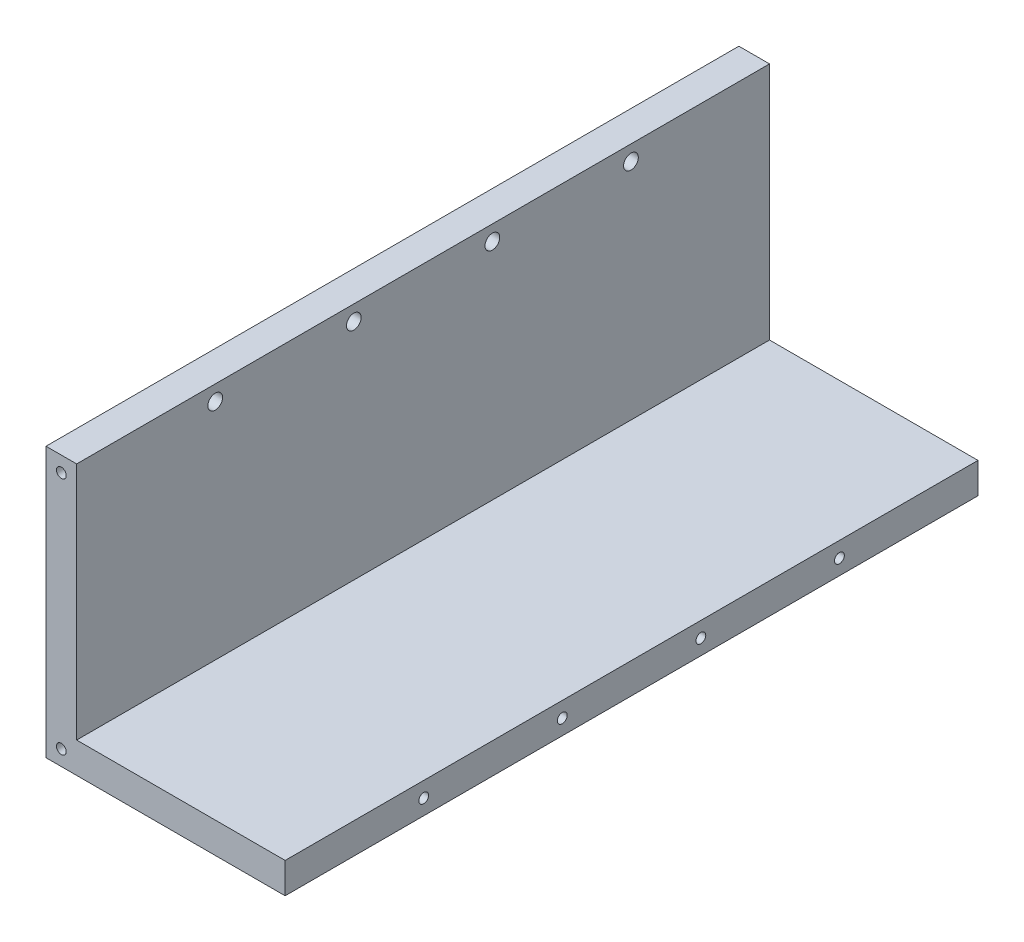
ISO-10303-21;
HEADER;
FILE_DESCRIPTION(('STEP AP214'),'2;1');
FILE_NAME('part.step','',(''),(''),'','','');
FILE_SCHEMA(('AUTOMOTIVE_DESIGN { 1 0 10303 214 1 1 1 1 }'));
ENDSEC;
DATA;
#1=APPLICATION_CONTEXT('core data for automotive mechanical design processes');
#2=APPLICATION_PROTOCOL_DEFINITION('international standard','automotive_design',2000,#1);
#3=PRODUCT_CONTEXT('',#1,'mechanical');
#4=PRODUCT('Part','Part','',(#3));
#5=PRODUCT_RELATED_PRODUCT_CATEGORY('part','',(#4));
#6=PRODUCT_DEFINITION_FORMATION('','',#4);
#7=PRODUCT_DEFINITION_CONTEXT('part definition',#1,'design');
#8=PRODUCT_DEFINITION('design','',#6,#7);
#9=PRODUCT_DEFINITION_SHAPE('','',#8);
#10=(LENGTH_UNIT() NAMED_UNIT(*) SI_UNIT(.MILLI.,.METRE.));
#11=(NAMED_UNIT(*) PLANE_ANGLE_UNIT() SI_UNIT($,.RADIAN.));
#12=(NAMED_UNIT(*) SI_UNIT($,.STERADIAN.) SOLID_ANGLE_UNIT());
#13=UNCERTAINTY_MEASURE_WITH_UNIT(LENGTH_MEASURE(1.E-05),#10,'distance_accuracy_value','');
#14=(GEOMETRIC_REPRESENTATION_CONTEXT(3) GLOBAL_UNCERTAINTY_ASSIGNED_CONTEXT((#13)) GLOBAL_UNIT_ASSIGNED_CONTEXT((#10,
#11,#12)) REPRESENTATION_CONTEXT('',''));
#15=CARTESIAN_POINT('',(0.,0.,0.));
#16=DIRECTION('',(0.,0.,1.));
#17=DIRECTION('',(1.,0.,0.));
#18=AXIS2_PLACEMENT_3D('',#15,#16,#17);
#19=CARTESIAN_POINT('',(0.,0.,113.));
#20=DIRECTION('',(-1.,0.,0.));
#21=DIRECTION('',(0.,0.,1.));
#22=AXIS2_PLACEMENT_3D('',#19,#20,#21);
#23=PLANE('',#22);
#24=DIRECTION('',(0.,1.,0.));
#25=VECTOR('',#24,1.);
#26=CARTESIAN_POINT('',(0.,0.,0.));
#27=LINE('',#26,#25);
#28=CARTESIAN_POINT('',(0.,0.,0.));
#29=VERTEX_POINT('',#28);
#30=CARTESIAN_POINT('',(0.,39.,0.));
#31=VERTEX_POINT('',#30);
#32=EDGE_CURVE('E136',#29,#31,#27,.T.);
#33=ORIENTED_EDGE('',*,*,#32,.T.);
#34=DIRECTION('',(0.,0.,-1.));
#35=VECTOR('',#34,1.);
#36=CARTESIAN_POINT('',(0.,39.,113.));
#37=LINE('',#36,#35);
#38=CARTESIAN_POINT('',(0.,39.,113.));
#39=VERTEX_POINT('',#38);
#40=EDGE_CURVE('E54',#39,#31,#37,.T.);
#41=ORIENTED_EDGE('',*,*,#40,.F.);
#42=DIRECTION('',(0.,1.,0.));
#43=VECTOR('',#42,1.);
#44=CARTESIAN_POINT('',(0.,0.,113.));
#45=LINE('',#44,#43);
#46=CARTESIAN_POINT('',(0.,0.,113.));
#47=VERTEX_POINT('',#46);
#48=EDGE_CURVE('E99',#47,#39,#45,.T.);
#49=ORIENTED_EDGE('',*,*,#48,.F.);
#50=DIRECTION('',(0.,0.,-1.));
#51=VECTOR('',#50,1.);
#52=CARTESIAN_POINT('',(0.,0.,113.));
#53=LINE('',#52,#51);
#54=EDGE_CURVE('E11',#47,#29,#53,.T.);
#55=ORIENTED_EDGE('',*,*,#54,.T.);
#56=EDGE_LOOP('',(#33,#41,#49,#55));
#57=FACE_BOUND('',#56,.T.);
#58=CARTESIAN_POINT('',(0.,36.5,22.6));
#59=DIRECTION('',(-1.,0.,0.));
#60=DIRECTION('',(0.,0.,1.));
#61=AXIS2_PLACEMENT_3D('',#58,#59,#60);
#62=CIRCLE('',#61,1.2);
#63=CARTESIAN_POINT('',(0.,36.5,23.8));
#64=VERTEX_POINT('',#63);
#65=EDGE_CURVE('E137',#64,#64,#62,.F.);
#66=ORIENTED_EDGE('',*,*,#65,.F.);
#67=EDGE_LOOP('',(#66));
#68=FACE_BOUND('',#67,.T.);
#69=CARTESIAN_POINT('',(0.,36.5,45.2));
#70=DIRECTION('',(-1.,0.,0.));
#71=DIRECTION('',(0.,0.,1.));
#72=AXIS2_PLACEMENT_3D('',#69,#70,#71);
#73=CIRCLE('',#72,1.2);
#74=CARTESIAN_POINT('',(0.,36.5,46.4));
#75=VERTEX_POINT('',#74);
#76=EDGE_CURVE('E201',#75,#75,#73,.F.);
#77=ORIENTED_EDGE('',*,*,#76,.F.);
#78=EDGE_LOOP('',(#77));
#79=FACE_BOUND('',#78,.T.);
#80=CARTESIAN_POINT('',(0.,36.5,90.4));
#81=DIRECTION('',(-1.,0.,0.));
#82=DIRECTION('',(0.,0.,1.));
#83=AXIS2_PLACEMENT_3D('',#80,#81,#82);
#84=CIRCLE('',#83,1.2);
#85=CARTESIAN_POINT('',(0.,36.5,91.6));
#86=VERTEX_POINT('',#85);
#87=EDGE_CURVE('E215',#86,#86,#84,.F.);
#88=ORIENTED_EDGE('',*,*,#87,.F.);
#89=EDGE_LOOP('',(#88));
#90=FACE_BOUND('',#89,.T.);
#91=CARTESIAN_POINT('',(0.,36.5,67.8));
#92=DIRECTION('',(-1.,0.,0.));
#93=DIRECTION('',(0.,0.,1.));
#94=AXIS2_PLACEMENT_3D('',#91,#92,#93);
#95=CIRCLE('',#94,1.2);
#96=CARTESIAN_POINT('',(0.,36.5,69.));
#97=VERTEX_POINT('',#96);
#98=EDGE_CURVE('E221',#97,#97,#95,.F.);
#99=ORIENTED_EDGE('',*,*,#98,.F.);
#100=EDGE_LOOP('',(#99));
#101=FACE_BOUND('',#100,.T.);
#102=ADVANCED_FACE('F45',(#57,#68,#79,#90,#101),#23,.F.);
#103=CARTESIAN_POINT('',(0.,0.,113.));
#104=DIRECTION('',(0.,-1.,0.));
#105=DIRECTION('',(1.,0.,0.));
#106=AXIS2_PLACEMENT_3D('',#103,#104,#105);
#107=PLANE('',#106);
#108=DIRECTION('',(-1.,0.,0.));
#109=VECTOR('',#108,1.);
#110=CARTESIAN_POINT('',(0.,0.,0.));
#111=LINE('',#110,#109);
#112=CARTESIAN_POINT('',(34.,0.,0.));
#113=VERTEX_POINT('',#112);
#114=EDGE_CURVE('E133',#113,#29,#111,.T.);
#115=ORIENTED_EDGE('',*,*,#114,.T.);
#116=ORIENTED_EDGE('',*,*,#54,.F.);
#117=DIRECTION('',(-1.,0.,0.));
#118=VECTOR('',#117,1.);
#119=CARTESIAN_POINT('',(0.,0.,113.));
#120=LINE('',#119,#118);
#121=CARTESIAN_POINT('',(34.,0.,113.));
#122=VERTEX_POINT('',#121);
#123=EDGE_CURVE('E144',#122,#47,#120,.T.);
#124=ORIENTED_EDGE('',*,*,#123,.F.);
#125=DIRECTION('',(0.,0.,-1.));
#126=VECTOR('',#125,1.);
#127=CARTESIAN_POINT('',(34.,0.,113.));
#128=LINE('',#127,#126);
#129=EDGE_CURVE('E129',#122,#113,#128,.T.);
#130=ORIENTED_EDGE('',*,*,#129,.T.);
#131=EDGE_LOOP('',(#115,#116,#124,#130));
#132=FACE_BOUND('',#131,.T.);
#133=ADVANCED_FACE('F47',(#132),#107,.F.);
#134=CARTESIAN_POINT('',(0.,39.,113.));
#135=DIRECTION('',(0.,-1.,0.));
#136=DIRECTION('',(0.,0.,-1.));
#137=AXIS2_PLACEMENT_3D('',#134,#135,#136);
#138=PLANE('',#137);
#139=DIRECTION('',(-1.,0.,0.));
#140=VECTOR('',#139,1.);
#141=CARTESIAN_POINT('',(0.,39.,0.));
#142=LINE('',#141,#140);
#143=CARTESIAN_POINT('',(-5.,39.,0.));
#144=VERTEX_POINT('',#143);
#145=EDGE_CURVE('E139',#31,#144,#142,.T.);
#146=ORIENTED_EDGE('',*,*,#145,.T.);
#147=DIRECTION('',(0.,0.,-1.));
#148=VECTOR('',#147,1.);
#149=CARTESIAN_POINT('',(-5.,39.,113.));
#150=LINE('',#149,#148);
#151=CARTESIAN_POINT('',(-5.,39.,113.));
#152=VERTEX_POINT('',#151);
#153=EDGE_CURVE('E124',#152,#144,#150,.T.);
#154=ORIENTED_EDGE('',*,*,#153,.F.);
#155=DIRECTION('',(-1.,0.,0.));
#156=VECTOR('',#155,1.);
#157=CARTESIAN_POINT('',(0.,39.,113.));
#158=LINE('',#157,#156);
#159=EDGE_CURVE('E114',#39,#152,#158,.T.);
#160=ORIENTED_EDGE('',*,*,#159,.F.);
#161=ORIENTED_EDGE('',*,*,#40,.T.);
#162=EDGE_LOOP('',(#146,#154,#160,#161));
#163=FACE_BOUND('',#162,.T.);
#164=ADVANCED_FACE('F150',(#163),#138,.F.);
#165=CARTESIAN_POINT('',(-5.,-5.,113.));
#166=DIRECTION('',(1.,0.,0.));
#167=DIRECTION('',(0.,1.,0.));
#168=AXIS2_PLACEMENT_3D('',#165,#166,#167);
#169=PLANE('',#168);
#170=CARTESIAN_POINT('',(-5.,36.5,67.8));
#171=DIRECTION('',(-1.,0.,0.));
#172=DIRECTION('',(0.,0.,1.));
#173=AXIS2_PLACEMENT_3D('',#170,#171,#172);
#174=CIRCLE('',#173,2.2);
#175=CARTESIAN_POINT('',(-5.,36.5,70.));
#176=VERTEX_POINT('',#175);
#177=EDGE_CURVE('E187',#176,#176,#174,.T.);
#178=ORIENTED_EDGE('',*,*,#177,.F.);
#179=EDGE_LOOP('',(#178));
#180=FACE_BOUND('',#179,.T.);
#181=CARTESIAN_POINT('',(-5.,36.5,90.4));
#182=DIRECTION('',(-1.,0.,0.));
#183=DIRECTION('',(0.,0.,1.));
#184=AXIS2_PLACEMENT_3D('',#181,#182,#183);
#185=CIRCLE('',#184,2.2);
#186=CARTESIAN_POINT('',(-5.,36.5,92.6));
#187=VERTEX_POINT('',#186);
#188=EDGE_CURVE('E191',#187,#187,#185,.T.);
#189=ORIENTED_EDGE('',*,*,#188,.F.);
#190=EDGE_LOOP('',(#189));
#191=FACE_BOUND('',#190,.T.);
#192=CARTESIAN_POINT('',(-5.,36.5,45.2));
#193=DIRECTION('',(-1.,0.,0.));
#194=DIRECTION('',(0.,0.,1.));
#195=AXIS2_PLACEMENT_3D('',#192,#193,#194);
#196=CIRCLE('',#195,2.2);
#197=CARTESIAN_POINT('',(-5.,36.5,47.4));
#198=VERTEX_POINT('',#197);
#199=EDGE_CURVE('E195',#198,#198,#196,.T.);
#200=ORIENTED_EDGE('',*,*,#199,.F.);
#201=EDGE_LOOP('',(#200));
#202=FACE_BOUND('',#201,.T.);
#203=CARTESIAN_POINT('',(-5.,36.5,22.6));
#204=DIRECTION('',(-1.,0.,0.));
#205=DIRECTION('',(0.,0.,1.));
#206=AXIS2_PLACEMENT_3D('',#203,#204,#205);
#207=CIRCLE('',#206,2.2);
#208=CARTESIAN_POINT('',(-5.,36.5,24.8));
#209=VERTEX_POINT('',#208);
#210=EDGE_CURVE('E198',#209,#209,#207,.T.);
#211=ORIENTED_EDGE('',*,*,#210,.F.);
#212=EDGE_LOOP('',(#211));
#213=FACE_BOUND('',#212,.T.);
#214=DIRECTION('',(0.,-1.,0.));
#215=VECTOR('',#214,1.);
#216=CARTESIAN_POINT('',(-5.,-5.,0.));
#217=LINE('',#216,#215);
#218=CARTESIAN_POINT('',(-5.,-5.,0.));
#219=VERTEX_POINT('',#218);
#220=EDGE_CURVE('E123',#144,#219,#217,.T.);
#221=ORIENTED_EDGE('',*,*,#220,.T.);
#222=DIRECTION('',(0.,0.,-1.));
#223=VECTOR('',#222,1.);
#224=CARTESIAN_POINT('',(-5.,-5.,113.));
#225=LINE('',#224,#223);
#226=CARTESIAN_POINT('',(-5.,-5.,113.));
#227=VERTEX_POINT('',#226);
#228=EDGE_CURVE('E120',#227,#219,#225,.T.);
#229=ORIENTED_EDGE('',*,*,#228,.F.);
#230=DIRECTION('',(0.,-1.,0.));
#231=VECTOR('',#230,1.);
#232=CARTESIAN_POINT('',(-5.,-5.,113.));
#233=LINE('',#232,#231);
#234=EDGE_CURVE('E108',#152,#227,#233,.T.);
#235=ORIENTED_EDGE('',*,*,#234,.F.);
#236=ORIENTED_EDGE('',*,*,#153,.T.);
#237=EDGE_LOOP('',(#221,#229,#235,#236));
#238=FACE_BOUND('',#237,.T.);
#239=ADVANCED_FACE('F121',(#180,#191,#202,#213,#238),#169,.F.);
#240=CARTESIAN_POINT('',(0.,-5.,113.));
#241=DIRECTION('',(0.,1.,0.));
#242=DIRECTION('',(-1.,0.,0.));
#243=AXIS2_PLACEMENT_3D('',#240,#241,#242);
#244=PLANE('',#243);
#245=DIRECTION('',(1.,0.,0.));
#246=VECTOR('',#245,1.);
#247=CARTESIAN_POINT('',(0.,-5.,0.));
#248=LINE('',#247,#246);
#249=CARTESIAN_POINT('',(34.,-5.,0.));
#250=VERTEX_POINT('',#249);
#251=EDGE_CURVE('E85',#219,#250,#248,.T.);
#252=ORIENTED_EDGE('',*,*,#251,.T.);
#253=DIRECTION('',(0.,0.,-1.));
#254=VECTOR('',#253,1.);
#255=CARTESIAN_POINT('',(34.,-5.,113.));
#256=LINE('',#255,#254);
#257=CARTESIAN_POINT('',(34.,-5.,113.));
#258=VERTEX_POINT('',#257);
#259=EDGE_CURVE('E125',#258,#250,#256,.T.);
#260=ORIENTED_EDGE('',*,*,#259,.F.);
#261=DIRECTION('',(1.,0.,0.));
#262=VECTOR('',#261,1.);
#263=CARTESIAN_POINT('',(0.,-5.,113.));
#264=LINE('',#263,#262);
#265=EDGE_CURVE('E112',#227,#258,#264,.T.);
#266=ORIENTED_EDGE('',*,*,#265,.F.);
#267=ORIENTED_EDGE('',*,*,#228,.T.);
#268=EDGE_LOOP('',(#252,#260,#266,#267));
#269=FACE_BOUND('',#268,.T.);
#270=ADVANCED_FACE('F127',(#269),#244,.F.);
#271=CARTESIAN_POINT('',(34.,0.,113.));
#272=DIRECTION('',(-1.,0.,0.));
#273=DIRECTION('',(0.,0.,1.));
#274=AXIS2_PLACEMENT_3D('',#271,#272,#273);
#275=PLANE('',#274);
#276=CARTESIAN_POINT('',(34.,-2.5,67.8));
#277=DIRECTION('',(1.,0.,0.));
#278=DIRECTION('',(0.,0.,-1.));
#279=AXIS2_PLACEMENT_3D('',#276,#277,#278);
#280=CIRCLE('',#279,0.799999999999999);
#281=CARTESIAN_POINT('',(34.,-2.5,67.));
#282=VERTEX_POINT('',#281);
#283=EDGE_CURVE('E251',#282,#282,#280,.T.);
#284=ORIENTED_EDGE('',*,*,#283,.F.);
#285=EDGE_LOOP('',(#284));
#286=FACE_BOUND('',#285,.T.);
#287=CARTESIAN_POINT('',(34.,-2.5,90.4));
#288=DIRECTION('',(1.,0.,0.));
#289=DIRECTION('',(0.,0.,-1.));
#290=AXIS2_PLACEMENT_3D('',#287,#288,#289);
#291=CIRCLE('',#290,0.799999999999999);
#292=CARTESIAN_POINT('',(34.,-2.5,89.6));
#293=VERTEX_POINT('',#292);
#294=EDGE_CURVE('E245',#293,#293,#291,.T.);
#295=ORIENTED_EDGE('',*,*,#294,.F.);
#296=EDGE_LOOP('',(#295));
#297=FACE_BOUND('',#296,.T.);
#298=CARTESIAN_POINT('',(34.,-2.5,45.2));
#299=DIRECTION('',(1.,0.,0.));
#300=DIRECTION('',(0.,0.,-1.));
#301=AXIS2_PLACEMENT_3D('',#298,#299,#300);
#302=CIRCLE('',#301,0.799999999999999);
#303=CARTESIAN_POINT('',(34.,-2.5,44.4));
#304=VERTEX_POINT('',#303);
#305=EDGE_CURVE('E239',#304,#304,#302,.T.);
#306=ORIENTED_EDGE('',*,*,#305,.F.);
#307=EDGE_LOOP('',(#306));
#308=FACE_BOUND('',#307,.T.);
#309=CARTESIAN_POINT('',(34.,-2.5,22.6));
#310=DIRECTION('',(1.,0.,0.));
#311=DIRECTION('',(0.,0.,-1.));
#312=AXIS2_PLACEMENT_3D('',#309,#310,#311);
#313=CIRCLE('',#312,0.799999999999999);
#314=CARTESIAN_POINT('',(34.,-2.5,21.8));
#315=VERTEX_POINT('',#314);
#316=EDGE_CURVE('E233',#315,#315,#313,.T.);
#317=ORIENTED_EDGE('',*,*,#316,.F.);
#318=EDGE_LOOP('',(#317));
#319=FACE_BOUND('',#318,.T.);
#320=DIRECTION('',(0.,1.,0.));
#321=VECTOR('',#320,1.);
#322=CARTESIAN_POINT('',(34.,0.,0.));
#323=LINE('',#322,#321);
#324=EDGE_CURVE('E91',#250,#113,#323,.T.);
#325=ORIENTED_EDGE('',*,*,#324,.T.);
#326=ORIENTED_EDGE('',*,*,#129,.F.);
#327=DIRECTION('',(0.,1.,0.));
#328=VECTOR('',#327,1.);
#329=CARTESIAN_POINT('',(34.,0.,113.));
#330=LINE('',#329,#328);
#331=EDGE_CURVE('E62',#258,#122,#330,.T.);
#332=ORIENTED_EDGE('',*,*,#331,.F.);
#333=ORIENTED_EDGE('',*,*,#259,.T.);
#334=EDGE_LOOP('',(#325,#326,#332,#333));
#335=FACE_BOUND('',#334,.T.);
#336=ADVANCED_FACE('F157',(#286,#297,#308,#319,#335),#275,.F.);
#337=CARTESIAN_POINT('',(0.,0.,113.));
#338=DIRECTION('',(0.,0.,-1.));
#339=DIRECTION('',(-1.,0.,0.));
#340=AXIS2_PLACEMENT_3D('',#337,#338,#339);
#341=PLANE('',#340);
#342=CARTESIAN_POINT('',(-2.5,36.5,113.));
#343=DIRECTION('',(0.,0.,1.));
#344=DIRECTION('',(1.,0.,0.));
#345=AXIS2_PLACEMENT_3D('',#342,#343,#344);
#346=CIRCLE('',#345,0.799999999999988);
#347=CARTESIAN_POINT('',(-1.70000000000001,36.5,113.));
#348=VERTEX_POINT('',#347);
#349=EDGE_CURVE('E263',#348,#348,#346,.T.);
#350=ORIENTED_EDGE('',*,*,#349,.F.);
#351=EDGE_LOOP('',(#350));
#352=FACE_BOUND('',#351,.T.);
#353=CARTESIAN_POINT('',(-2.5,-2.5,113.));
#354=DIRECTION('',(0.,0.,1.));
#355=DIRECTION('',(1.,0.,0.));
#356=AXIS2_PLACEMENT_3D('',#353,#354,#355);
#357=CIRCLE('',#356,0.799999999999988);
#358=CARTESIAN_POINT('',(-1.70000000000001,-2.5,113.));
#359=VERTEX_POINT('',#358);
#360=EDGE_CURVE('E257',#359,#359,#357,.T.);
#361=ORIENTED_EDGE('',*,*,#360,.F.);
#362=EDGE_LOOP('',(#361));
#363=FACE_BOUND('',#362,.T.);
#364=ORIENTED_EDGE('',*,*,#123,.T.);
#365=ORIENTED_EDGE('',*,*,#48,.T.);
#366=ORIENTED_EDGE('',*,*,#159,.T.);
#367=ORIENTED_EDGE('',*,*,#234,.T.);
#368=ORIENTED_EDGE('',*,*,#265,.T.);
#369=ORIENTED_EDGE('',*,*,#331,.T.);
#370=EDGE_LOOP('',(#364,#365,#366,#367,#368,#369));
#371=FACE_BOUND('',#370,.T.);
#372=ADVANCED_FACE('F110',(#352,#363,#371),#341,.F.);
#373=CARTESIAN_POINT('',(0.,0.,0.));
#374=DIRECTION('',(0.,0.,-1.));
#375=DIRECTION('',(-1.,0.,0.));
#376=AXIS2_PLACEMENT_3D('',#373,#374,#375);
#377=PLANE('',#376);
#378=CARTESIAN_POINT('',(-2.5,36.5,0.));
#379=DIRECTION('',(0.,0.,-1.));
#380=DIRECTION('',(-1.,0.,0.));
#381=AXIS2_PLACEMENT_3D('',#378,#379,#380);
#382=CIRCLE('',#381,0.799999999999988);
#383=CARTESIAN_POINT('',(-3.29999999999998,36.5,0.));
#384=VERTEX_POINT('',#383);
#385=EDGE_CURVE('E275',#384,#384,#382,.T.);
#386=ORIENTED_EDGE('',*,*,#385,.F.);
#387=EDGE_LOOP('',(#386));
#388=FACE_BOUND('',#387,.T.);
#389=CARTESIAN_POINT('',(-2.5,-2.5,0.));
#390=DIRECTION('',(0.,0.,-1.));
#391=DIRECTION('',(-1.,0.,0.));
#392=AXIS2_PLACEMENT_3D('',#389,#390,#391);
#393=CIRCLE('',#392,0.799999999999988);
#394=CARTESIAN_POINT('',(-3.29999999999998,-2.5,0.));
#395=VERTEX_POINT('',#394);
#396=EDGE_CURVE('E269',#395,#395,#393,.T.);
#397=ORIENTED_EDGE('',*,*,#396,.F.);
#398=EDGE_LOOP('',(#397));
#399=FACE_BOUND('',#398,.T.);
#400=ORIENTED_EDGE('',*,*,#114,.F.);
#401=ORIENTED_EDGE('',*,*,#324,.F.);
#402=ORIENTED_EDGE('',*,*,#251,.F.);
#403=ORIENTED_EDGE('',*,*,#220,.F.);
#404=ORIENTED_EDGE('',*,*,#145,.F.);
#405=ORIENTED_EDGE('',*,*,#32,.F.);
#406=EDGE_LOOP('',(#400,#401,#402,#403,#404,#405));
#407=FACE_BOUND('',#406,.T.);
#408=ADVANCED_FACE('F153',(#388,#399,#407),#377,.T.);
#409=CARTESIAN_POINT('',(-5.,36.5,22.6));
#410=DIRECTION('',(-1.,0.,0.));
#411=DIRECTION('',(0.,0.,1.));
#412=AXIS2_PLACEMENT_3D('',#409,#410,#411);
#413=CYLINDRICAL_SURFACE('',#412,1.2);
#414=ORIENTED_EDGE('',*,*,#65,.T.);
#415=EDGE_LOOP('',(#414));
#416=FACE_BOUND('',#415,.T.);
#417=CARTESIAN_POINT('',(-4.,36.5,22.6));
#418=DIRECTION('',(-1.,0.,0.));
#419=DIRECTION('',(0.,0.,1.));
#420=AXIS2_PLACEMENT_3D('',#417,#418,#419);
#421=CIRCLE('',#420,1.2);
#422=CARTESIAN_POINT('',(-4.,36.5,23.8));
#423=VERTEX_POINT('',#422);
#424=EDGE_CURVE('E200',#423,#423,#421,.T.);
#425=ORIENTED_EDGE('',*,*,#424,.T.);
#426=EDGE_LOOP('',(#425));
#427=FACE_BOUND('',#426,.T.);
#428=ADVANCED_FACE('F283',(#416,#427),#413,.F.);
#429=CARTESIAN_POINT('',(-5.,36.5,22.6));
#430=DIRECTION('',(-1.,0.,0.));
#431=DIRECTION('',(0.,0.,1.));
#432=AXIS2_PLACEMENT_3D('',#429,#430,#431);
#433=CONICAL_SURFACE('',#432,2.2,0.785398163397448);
#434=ORIENTED_EDGE('',*,*,#424,.F.);
#435=EDGE_LOOP('',(#434));
#436=FACE_BOUND('',#435,.T.);
#437=ORIENTED_EDGE('',*,*,#210,.T.);
#438=EDGE_LOOP('',(#437));
#439=FACE_BOUND('',#438,.T.);
#440=ADVANCED_FACE('F375',(#436,#439),#433,.F.);
#441=CARTESIAN_POINT('',(-5.,36.5,45.2));
#442=DIRECTION('',(-1.,0.,0.));
#443=DIRECTION('',(0.,0.,1.));
#444=AXIS2_PLACEMENT_3D('',#441,#442,#443);
#445=CYLINDRICAL_SURFACE('',#444,1.2);
#446=ORIENTED_EDGE('',*,*,#76,.T.);
#447=EDGE_LOOP('',(#446));
#448=FACE_BOUND('',#447,.T.);
#449=CARTESIAN_POINT('',(-4.,36.5,45.2));
#450=DIRECTION('',(-1.,0.,0.));
#451=DIRECTION('',(0.,0.,1.));
#452=AXIS2_PLACEMENT_3D('',#449,#450,#451);
#453=CIRCLE('',#452,1.2);
#454=CARTESIAN_POINT('',(-4.,36.5,46.4));
#455=VERTEX_POINT('',#454);
#456=EDGE_CURVE('E206',#455,#455,#453,.T.);
#457=ORIENTED_EDGE('',*,*,#456,.T.);
#458=EDGE_LOOP('',(#457));
#459=FACE_BOUND('',#458,.T.);
#460=ADVANCED_FACE('F371',(#448,#459),#445,.F.);
#461=CARTESIAN_POINT('',(-5.,36.5,45.2));
#462=DIRECTION('',(-1.,0.,0.));
#463=DIRECTION('',(0.,0.,1.));
#464=AXIS2_PLACEMENT_3D('',#461,#462,#463);
#465=CONICAL_SURFACE('',#464,2.2,0.785398163397448);
#466=ORIENTED_EDGE('',*,*,#456,.F.);
#467=EDGE_LOOP('',(#466));
#468=FACE_BOUND('',#467,.T.);
#469=ORIENTED_EDGE('',*,*,#199,.T.);
#470=EDGE_LOOP('',(#469));
#471=FACE_BOUND('',#470,.T.);
#472=ADVANCED_FACE('F367',(#468,#471),#465,.F.);
#473=CARTESIAN_POINT('',(-5.,36.5,90.4));
#474=DIRECTION('',(-1.,0.,0.));
#475=DIRECTION('',(0.,0.,1.));
#476=AXIS2_PLACEMENT_3D('',#473,#474,#475);
#477=CYLINDRICAL_SURFACE('',#476,1.2);
#478=ORIENTED_EDGE('',*,*,#87,.T.);
#479=EDGE_LOOP('',(#478));
#480=FACE_BOUND('',#479,.T.);
#481=CARTESIAN_POINT('',(-4.,36.5,90.4));
#482=DIRECTION('',(-1.,0.,0.));
#483=DIRECTION('',(0.,0.,1.));
#484=AXIS2_PLACEMENT_3D('',#481,#482,#483);
#485=CIRCLE('',#484,1.2);
#486=CARTESIAN_POINT('',(-4.,36.5,91.6));
#487=VERTEX_POINT('',#486);
#488=EDGE_CURVE('E217',#487,#487,#485,.T.);
#489=ORIENTED_EDGE('',*,*,#488,.T.);
#490=EDGE_LOOP('',(#489));
#491=FACE_BOUND('',#490,.T.);
#492=ADVANCED_FACE('F363',(#480,#491),#477,.F.);
#493=CARTESIAN_POINT('',(-5.,36.5,90.4));
#494=DIRECTION('',(-1.,0.,0.));
#495=DIRECTION('',(0.,0.,1.));
#496=AXIS2_PLACEMENT_3D('',#493,#494,#495);
#497=CONICAL_SURFACE('',#496,2.2,0.785398163397448);
#498=ORIENTED_EDGE('',*,*,#488,.F.);
#499=EDGE_LOOP('',(#498));
#500=FACE_BOUND('',#499,.T.);
#501=ORIENTED_EDGE('',*,*,#188,.T.);
#502=EDGE_LOOP('',(#501));
#503=FACE_BOUND('',#502,.T.);
#504=ADVANCED_FACE('F359',(#500,#503),#497,.F.);
#505=CARTESIAN_POINT('',(-5.,36.5,67.8));
#506=DIRECTION('',(-1.,0.,0.));
#507=DIRECTION('',(0.,0.,1.));
#508=AXIS2_PLACEMENT_3D('',#505,#506,#507);
#509=CYLINDRICAL_SURFACE('',#508,1.2);
#510=ORIENTED_EDGE('',*,*,#98,.T.);
#511=EDGE_LOOP('',(#510));
#512=FACE_BOUND('',#511,.T.);
#513=CARTESIAN_POINT('',(-4.,36.5,67.8));
#514=DIRECTION('',(-1.,0.,0.));
#515=DIRECTION('',(0.,0.,1.));
#516=AXIS2_PLACEMENT_3D('',#513,#514,#515);
#517=CIRCLE('',#516,1.2);
#518=CARTESIAN_POINT('',(-4.,36.5,69.));
#519=VERTEX_POINT('',#518);
#520=EDGE_CURVE('E224',#519,#519,#517,.T.);
#521=ORIENTED_EDGE('',*,*,#520,.T.);
#522=EDGE_LOOP('',(#521));
#523=FACE_BOUND('',#522,.T.);
#524=ADVANCED_FACE('F355',(#512,#523),#509,.F.);
#525=CARTESIAN_POINT('',(-5.,36.5,67.8));
#526=DIRECTION('',(-1.,0.,0.));
#527=DIRECTION('',(0.,0.,1.));
#528=AXIS2_PLACEMENT_3D('',#525,#526,#527);
#529=CONICAL_SURFACE('',#528,2.2,0.785398163397448);
#530=ORIENTED_EDGE('',*,*,#520,.F.);
#531=EDGE_LOOP('',(#530));
#532=FACE_BOUND('',#531,.T.);
#533=ORIENTED_EDGE('',*,*,#177,.T.);
#534=EDGE_LOOP('',(#533));
#535=FACE_BOUND('',#534,.T.);
#536=ADVANCED_FACE('F351',(#532,#535),#529,.F.);
#537=CARTESIAN_POINT('',(26.,-2.5,22.6));
#538=DIRECTION('',(1.,0.,0.));
#539=DIRECTION('',(0.,0.,-1.));
#540=AXIS2_PLACEMENT_3D('',#537,#538,#539);
#541=CONICAL_SURFACE('',#540,0.799999999999998,1.02974425867665);
#542=CARTESIAN_POINT('',(25.519311504778,-2.5,22.6));
#543=VERTEX_POINT('',#542);
#544=VERTEX_LOOP('',#543);
#545=FACE_BOUND('',#544,.T.);
#546=CARTESIAN_POINT('',(26.,-2.5,22.6));
#547=DIRECTION('',(1.,0.,0.));
#548=DIRECTION('',(0.,0.,-1.));
#549=AXIS2_PLACEMENT_3D('',#546,#547,#548);
#550=CIRCLE('',#549,0.799999999999998);
#551=CARTESIAN_POINT('',(26.,-2.5,21.8));
#552=VERTEX_POINT('',#551);
#553=EDGE_CURVE('E228',#552,#552,#550,.T.);
#554=ORIENTED_EDGE('',*,*,#553,.T.);
#555=EDGE_LOOP('',(#554));
#556=FACE_BOUND('',#555,.T.);
#557=ADVANCED_FACE('F347',(#545,#556),#541,.F.);
#558=CARTESIAN_POINT('',(34.,-2.5,22.6));
#559=DIRECTION('',(1.,0.,0.));
#560=DIRECTION('',(0.,0.,-1.));
#561=AXIS2_PLACEMENT_3D('',#558,#559,#560);
#562=CYLINDRICAL_SURFACE('',#561,0.799999999999998);
#563=ORIENTED_EDGE('',*,*,#553,.F.);
#564=EDGE_LOOP('',(#563));
#565=FACE_BOUND('',#564,.T.);
#566=ORIENTED_EDGE('',*,*,#316,.T.);
#567=EDGE_LOOP('',(#566));
#568=FACE_BOUND('',#567,.T.);
#569=ADVANCED_FACE('F344',(#565,#568),#562,.F.);
#570=CARTESIAN_POINT('',(26.,-2.5,45.2));
#571=DIRECTION('',(1.,0.,0.));
#572=DIRECTION('',(0.,0.,-1.));
#573=AXIS2_PLACEMENT_3D('',#570,#571,#572);
#574=CONICAL_SURFACE('',#573,0.799999999999998,1.02974425867665);
#575=CARTESIAN_POINT('',(25.519311504778,-2.5,45.2));
#576=VERTEX_POINT('',#575);
#577=VERTEX_LOOP('',#576);
#578=FACE_BOUND('',#577,.T.);
#579=CARTESIAN_POINT('',(26.,-2.5,45.2));
#580=DIRECTION('',(1.,0.,0.));
#581=DIRECTION('',(0.,0.,-1.));
#582=AXIS2_PLACEMENT_3D('',#579,#580,#581);
#583=CIRCLE('',#582,0.799999999999998);
#584=CARTESIAN_POINT('',(26.,-2.5,44.4));
#585=VERTEX_POINT('',#584);
#586=EDGE_CURVE('E236',#585,#585,#583,.T.);
#587=ORIENTED_EDGE('',*,*,#586,.T.);
#588=EDGE_LOOP('',(#587));
#589=FACE_BOUND('',#588,.T.);
#590=ADVANCED_FACE('F340',(#578,#589),#574,.F.);
#591=CARTESIAN_POINT('',(34.,-2.5,45.2));
#592=DIRECTION('',(1.,0.,0.));
#593=DIRECTION('',(0.,0.,-1.));
#594=AXIS2_PLACEMENT_3D('',#591,#592,#593);
#595=CYLINDRICAL_SURFACE('',#594,0.799999999999998);
#596=ORIENTED_EDGE('',*,*,#586,.F.);
#597=EDGE_LOOP('',(#596));
#598=FACE_BOUND('',#597,.T.);
#599=ORIENTED_EDGE('',*,*,#305,.T.);
#600=EDGE_LOOP('',(#599));
#601=FACE_BOUND('',#600,.T.);
#602=ADVANCED_FACE('F336',(#598,#601),#595,.F.);
#603=CARTESIAN_POINT('',(26.,-2.5,90.4));
#604=DIRECTION('',(1.,0.,0.));
#605=DIRECTION('',(0.,0.,-1.));
#606=AXIS2_PLACEMENT_3D('',#603,#604,#605);
#607=CONICAL_SURFACE('',#606,0.799999999999998,1.02974425867665);
#608=CARTESIAN_POINT('',(25.519311504778,-2.5,90.4));
#609=VERTEX_POINT('',#608);
#610=VERTEX_LOOP('',#609);
#611=FACE_BOUND('',#610,.T.);
#612=CARTESIAN_POINT('',(26.,-2.5,90.4));
#613=DIRECTION('',(1.,0.,0.));
#614=DIRECTION('',(0.,0.,-1.));
#615=AXIS2_PLACEMENT_3D('',#612,#613,#614);
#616=CIRCLE('',#615,0.799999999999998);
#617=CARTESIAN_POINT('',(26.,-2.5,89.6));
#618=VERTEX_POINT('',#617);
#619=EDGE_CURVE('E242',#618,#618,#616,.T.);
#620=ORIENTED_EDGE('',*,*,#619,.T.);
#621=EDGE_LOOP('',(#620));
#622=FACE_BOUND('',#621,.T.);
#623=ADVANCED_FACE('F332',(#611,#622),#607,.F.);
#624=CARTESIAN_POINT('',(34.,-2.5,90.4));
#625=DIRECTION('',(1.,0.,0.));
#626=DIRECTION('',(0.,0.,-1.));
#627=AXIS2_PLACEMENT_3D('',#624,#625,#626);
#628=CYLINDRICAL_SURFACE('',#627,0.799999999999998);
#629=ORIENTED_EDGE('',*,*,#619,.F.);
#630=EDGE_LOOP('',(#629));
#631=FACE_BOUND('',#630,.T.);
#632=ORIENTED_EDGE('',*,*,#294,.T.);
#633=EDGE_LOOP('',(#632));
#634=FACE_BOUND('',#633,.T.);
#635=ADVANCED_FACE('F328',(#631,#634),#628,.F.);
#636=CARTESIAN_POINT('',(26.,-2.5,67.8));
#637=DIRECTION('',(1.,0.,0.));
#638=DIRECTION('',(0.,0.,-1.));
#639=AXIS2_PLACEMENT_3D('',#636,#637,#638);
#640=CONICAL_SURFACE('',#639,0.799999999999998,1.02974425867665);
#641=CARTESIAN_POINT('',(25.519311504778,-2.5,67.8));
#642=VERTEX_POINT('',#641);
#643=VERTEX_LOOP('',#642);
#644=FACE_BOUND('',#643,.T.);
#645=CARTESIAN_POINT('',(26.,-2.5,67.8));
#646=DIRECTION('',(1.,0.,0.));
#647=DIRECTION('',(0.,0.,-1.));
#648=AXIS2_PLACEMENT_3D('',#645,#646,#647);
#649=CIRCLE('',#648,0.799999999999998);
#650=CARTESIAN_POINT('',(26.,-2.5,67.));
#651=VERTEX_POINT('',#650);
#652=EDGE_CURVE('E248',#651,#651,#649,.T.);
#653=ORIENTED_EDGE('',*,*,#652,.T.);
#654=EDGE_LOOP('',(#653));
#655=FACE_BOUND('',#654,.T.);
#656=ADVANCED_FACE('F324',(#644,#655),#640,.F.);
#657=CARTESIAN_POINT('',(34.,-2.5,67.8));
#658=DIRECTION('',(1.,0.,0.));
#659=DIRECTION('',(0.,0.,-1.));
#660=AXIS2_PLACEMENT_3D('',#657,#658,#659);
#661=CYLINDRICAL_SURFACE('',#660,0.799999999999998);
#662=ORIENTED_EDGE('',*,*,#652,.F.);
#663=EDGE_LOOP('',(#662));
#664=FACE_BOUND('',#663,.T.);
#665=ORIENTED_EDGE('',*,*,#283,.T.);
#666=EDGE_LOOP('',(#665));
#667=FACE_BOUND('',#666,.T.);
#668=ADVANCED_FACE('F320',(#664,#667),#661,.F.);
#669=CARTESIAN_POINT('',(-2.5,-2.5,105.));
#670=DIRECTION('',(0.,0.,1.));
#671=DIRECTION('',(1.,0.,0.));
#672=AXIS2_PLACEMENT_3D('',#669,#670,#671);
#673=CONICAL_SURFACE('',#672,0.799999999999998,1.02974425867665);
#674=CARTESIAN_POINT('',(-2.5,-2.5,104.519311504778));
#675=VERTEX_POINT('',#674);
#676=VERTEX_LOOP('',#675);
#677=FACE_BOUND('',#676,.T.);
#678=CARTESIAN_POINT('',(-2.5,-2.5,105.));
#679=DIRECTION('',(0.,0.,1.));
#680=DIRECTION('',(1.,0.,0.));
#681=AXIS2_PLACEMENT_3D('',#678,#679,#680);
#682=CIRCLE('',#681,0.799999999999998);
#683=CARTESIAN_POINT('',(-1.7,-2.5,105.));
#684=VERTEX_POINT('',#683);
#685=EDGE_CURVE('E254',#684,#684,#682,.T.);
#686=ORIENTED_EDGE('',*,*,#685,.T.);
#687=EDGE_LOOP('',(#686));
#688=FACE_BOUND('',#687,.T.);
#689=ADVANCED_FACE('F316',(#677,#688),#673,.F.);
#690=CARTESIAN_POINT('',(-2.5,-2.5,113.));
#691=DIRECTION('',(0.,0.,1.));
#692=DIRECTION('',(1.,0.,0.));
#693=AXIS2_PLACEMENT_3D('',#690,#691,#692);
#694=CYLINDRICAL_SURFACE('',#693,0.799999999999993);
#695=ORIENTED_EDGE('',*,*,#685,.F.);
#696=EDGE_LOOP('',(#695));
#697=FACE_BOUND('',#696,.T.);
#698=ORIENTED_EDGE('',*,*,#360,.T.);
#699=EDGE_LOOP('',(#698));
#700=FACE_BOUND('',#699,.T.);
#701=ADVANCED_FACE('F312',(#697,#700),#694,.F.);
#702=CARTESIAN_POINT('',(-2.5,36.5,105.));
#703=DIRECTION('',(0.,0.,1.));
#704=DIRECTION('',(1.,0.,0.));
#705=AXIS2_PLACEMENT_3D('',#702,#703,#704);
#706=CONICAL_SURFACE('',#705,0.799999999999998,1.02974425867665);
#707=CARTESIAN_POINT('',(-2.5,36.5,104.519311504778));
#708=VERTEX_POINT('',#707);
#709=VERTEX_LOOP('',#708);
#710=FACE_BOUND('',#709,.T.);
#711=CARTESIAN_POINT('',(-2.5,36.5,105.));
#712=DIRECTION('',(0.,0.,1.));
#713=DIRECTION('',(1.,0.,0.));
#714=AXIS2_PLACEMENT_3D('',#711,#712,#713);
#715=CIRCLE('',#714,0.799999999999998);
#716=CARTESIAN_POINT('',(-1.7,36.5,105.));
#717=VERTEX_POINT('',#716);
#718=EDGE_CURVE('E260',#717,#717,#715,.T.);
#719=ORIENTED_EDGE('',*,*,#718,.T.);
#720=EDGE_LOOP('',(#719));
#721=FACE_BOUND('',#720,.T.);
#722=ADVANCED_FACE('F308',(#710,#721),#706,.F.);
#723=CARTESIAN_POINT('',(-2.5,36.5,113.));
#724=DIRECTION('',(0.,0.,1.));
#725=DIRECTION('',(1.,0.,0.));
#726=AXIS2_PLACEMENT_3D('',#723,#724,#725);
#727=CYLINDRICAL_SURFACE('',#726,0.799999999999993);
#728=ORIENTED_EDGE('',*,*,#718,.F.);
#729=EDGE_LOOP('',(#728));
#730=FACE_BOUND('',#729,.T.);
#731=ORIENTED_EDGE('',*,*,#349,.T.);
#732=EDGE_LOOP('',(#731));
#733=FACE_BOUND('',#732,.T.);
#734=ADVANCED_FACE('F300',(#730,#733),#727,.F.);
#735=CARTESIAN_POINT('',(-2.5,-2.5,8.));
#736=DIRECTION('',(0.,0.,-1.));
#737=DIRECTION('',(-1.,0.,0.));
#738=AXIS2_PLACEMENT_3D('',#735,#736,#737);
#739=CONICAL_SURFACE('',#738,0.799999999999998,1.02974425867665);
#740=CARTESIAN_POINT('',(-2.5,-2.5,8.48068849522205));
#741=VERTEX_POINT('',#740);
#742=VERTEX_LOOP('',#741);
#743=FACE_BOUND('',#742,.T.);
#744=CARTESIAN_POINT('',(-2.5,-2.5,8.));
#745=DIRECTION('',(0.,0.,-1.));
#746=DIRECTION('',(-1.,0.,0.));
#747=AXIS2_PLACEMENT_3D('',#744,#745,#746);
#748=CIRCLE('',#747,0.799999999999998);
#749=CARTESIAN_POINT('',(-3.29999999999999,-2.5,8.));
#750=VERTEX_POINT('',#749);
#751=EDGE_CURVE('E266',#750,#750,#748,.T.);
#752=ORIENTED_EDGE('',*,*,#751,.T.);
#753=EDGE_LOOP('',(#752));
#754=FACE_BOUND('',#753,.T.);
#755=ADVANCED_FACE('F289',(#743,#754),#739,.F.);
#756=CARTESIAN_POINT('',(-2.5,-2.5,0.));
#757=DIRECTION('',(0.,0.,-1.));
#758=DIRECTION('',(-1.,0.,0.));
#759=AXIS2_PLACEMENT_3D('',#756,#757,#758);
#760=CYLINDRICAL_SURFACE('',#759,0.799999999999993);
#761=ORIENTED_EDGE('',*,*,#751,.F.);
#762=EDGE_LOOP('',(#761));
#763=FACE_BOUND('',#762,.T.);
#764=ORIENTED_EDGE('',*,*,#396,.T.);
#765=EDGE_LOOP('',(#764));
#766=FACE_BOUND('',#765,.T.);
#767=ADVANCED_FACE('F286',(#763,#766),#760,.F.);
#768=CARTESIAN_POINT('',(-2.5,36.5,8.));
#769=DIRECTION('',(0.,0.,-1.));
#770=DIRECTION('',(-1.,0.,0.));
#771=AXIS2_PLACEMENT_3D('',#768,#769,#770);
#772=CONICAL_SURFACE('',#771,0.799999999999998,1.02974425867665);
#773=CARTESIAN_POINT('',(-2.5,36.5,8.48068849522205));
#774=VERTEX_POINT('',#773);
#775=VERTEX_LOOP('',#774);
#776=FACE_BOUND('',#775,.T.);
#777=CARTESIAN_POINT('',(-2.5,36.5,8.));
#778=DIRECTION('',(0.,0.,-1.));
#779=DIRECTION('',(-1.,0.,0.));
#780=AXIS2_PLACEMENT_3D('',#777,#778,#779);
#781=CIRCLE('',#780,0.799999999999998);
#782=CARTESIAN_POINT('',(-3.29999999999999,36.5,8.));
#783=VERTEX_POINT('',#782);
#784=EDGE_CURVE('E272',#783,#783,#781,.T.);
#785=ORIENTED_EDGE('',*,*,#784,.T.);
#786=EDGE_LOOP('',(#785));
#787=FACE_BOUND('',#786,.T.);
#788=ADVANCED_FACE('F288',(#776,#787),#772,.F.);
#789=CARTESIAN_POINT('',(-2.5,36.5,0.));
#790=DIRECTION('',(0.,0.,-1.));
#791=DIRECTION('',(-1.,0.,0.));
#792=AXIS2_PLACEMENT_3D('',#789,#790,#791);
#793=CYLINDRICAL_SURFACE('',#792,0.799999999999993);
#794=ORIENTED_EDGE('',*,*,#784,.F.);
#795=EDGE_LOOP('',(#794));
#796=FACE_BOUND('',#795,.T.);
#797=ORIENTED_EDGE('',*,*,#385,.T.);
#798=EDGE_LOOP('',(#797));
#799=FACE_BOUND('',#798,.T.);
#800=ADVANCED_FACE('F279',(#796,#799),#793,.F.);
#801=CLOSED_SHELL('',(#102,#133,#164,#239,#270,#336,#372,#408,#428,#440,#460,#472,#492,#504,
#524,#536,#557,#569,#590,#602,#623,#635,#656,#668,#689,#701,#722,#734,#755,#767,#788,#800));
#802=MANIFOLD_SOLID_BREP('B2',#801);
#803=ADVANCED_BREP_SHAPE_REPRESENTATION('',(#18,#802),#14);
#804=SHAPE_DEFINITION_REPRESENTATION(#9,#803);
ENDSEC;
END-ISO-10303-21;
